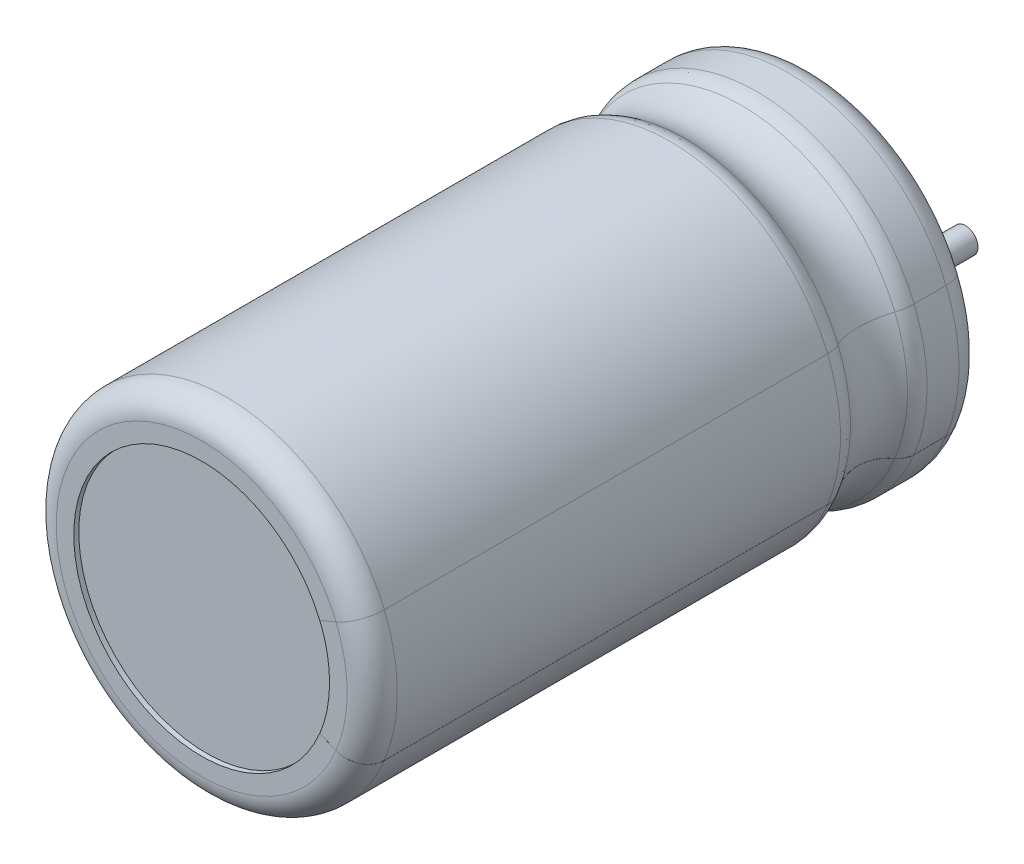
ISO-10303-21;
HEADER;
FILE_DESCRIPTION(('STEP AP214'),'2;1');
FILE_NAME('part.step','',(''),(''),'','','');
FILE_SCHEMA(('AUTOMOTIVE_DESIGN { 1 0 10303 214 1 1 1 1 }'));
ENDSEC;
DATA;
#1=APPLICATION_CONTEXT('core data for automotive mechanical design processes');
#2=APPLICATION_PROTOCOL_DEFINITION('international standard','automotive_design',2000,#1);
#3=PRODUCT_CONTEXT('',#1,'mechanical');
#4=PRODUCT('Part','Part','',(#3));
#5=PRODUCT_RELATED_PRODUCT_CATEGORY('part','',(#4));
#6=PRODUCT_DEFINITION_FORMATION('','',#4);
#7=PRODUCT_DEFINITION_CONTEXT('part definition',#1,'design');
#8=PRODUCT_DEFINITION('design','',#6,#7);
#9=PRODUCT_DEFINITION_SHAPE('','',#8);
#10=(LENGTH_UNIT() NAMED_UNIT(*) SI_UNIT(.MILLI.,.METRE.));
#11=(NAMED_UNIT(*) PLANE_ANGLE_UNIT() SI_UNIT($,.RADIAN.));
#12=(NAMED_UNIT(*) SI_UNIT($,.STERADIAN.) SOLID_ANGLE_UNIT());
#13=UNCERTAINTY_MEASURE_WITH_UNIT(LENGTH_MEASURE(1.E-05),#10,'distance_accuracy_value','');
#14=(GEOMETRIC_REPRESENTATION_CONTEXT(3) GLOBAL_UNCERTAINTY_ASSIGNED_CONTEXT((#13)) GLOBAL_UNIT_ASSIGNED_CONTEXT((#10,
#11,#12)) REPRESENTATION_CONTEXT('',''));
#15=CARTESIAN_POINT('',(0.,0.,0.));
#16=DIRECTION('',(0.,0.,1.));
#17=DIRECTION('',(1.,0.,0.));
#18=AXIS2_PLACEMENT_3D('',#15,#16,#17);
#19=CARTESIAN_POINT('',(0.,0.,-0.000999999999999946));
#20=DIRECTION('',(0.,0.,1.));
#21=DIRECTION('',(1.,0.,0.));
#22=AXIS2_PLACEMENT_3D('',#19,#20,#21);
#23=PLANE('',#22);
#24=CARTESIAN_POINT('',(0.,0.,-0.000999999999999916));
#25=DIRECTION('',(0.,0.,1.));
#26=DIRECTION('',(1.,0.,0.));
#27=AXIS2_PLACEMENT_3D('',#24,#25,#26);
#28=CIRCLE('',#27,2.9);
#29=CARTESIAN_POINT('',(2.67925064428274,1.10978195385874,-0.000999999999999946));
#30=VERTEX_POINT('',#29);
#31=CARTESIAN_POINT('',(2.67925064428274,-1.10978195385875,-0.000999999999999916));
#32=VERTEX_POINT('',#31);
#33=EDGE_CURVE('E293',#30,#32,#28,.T.);
#34=ORIENTED_EDGE('',*,*,#33,.F.);
#35=DIRECTION('',(0.923879532511289,0.382683432365084,0.));
#36=VECTOR('',#35,1.);
#37=CARTESIAN_POINT('',(0.,0.,-0.000999999999999946));
#38=LINE('',#37,#36);
#39=CARTESIAN_POINT('',(2.35589280790379,0.975842752530965,-0.000999999999999265));
#40=VERTEX_POINT('',#39);
#41=EDGE_CURVE('E342',#40,#30,#38,.T.);
#42=ORIENTED_EDGE('',*,*,#41,.F.);
#43=CARTESIAN_POINT('',(0.,0.,-0.000999999999999265));
#44=DIRECTION('',(0.,0.,1.));
#45=DIRECTION('',(1.,0.,0.));
#46=AXIS2_PLACEMENT_3D('',#43,#44,#45);
#47=CIRCLE('',#46,2.55);
#48=CARTESIAN_POINT('',(2.35589280790379,-0.975842752530964,-0.000999999999999946));
#49=VERTEX_POINT('',#48);
#50=EDGE_CURVE('E287',#49,#40,#47,.T.);
#51=ORIENTED_EDGE('',*,*,#50,.F.);
#52=DIRECTION('',(0.923879532511289,-0.382683432365084,0.));
#53=VECTOR('',#52,1.);
#54=CARTESIAN_POINT('',(0.,0.,-0.000999999999999946));
#55=LINE('',#54,#53);
#56=EDGE_CURVE('E314',#49,#32,#55,.T.);
#57=ORIENTED_EDGE('',*,*,#56,.T.);
#58=EDGE_LOOP('',(#34,#42,#51,#57));
#59=FACE_BOUND('',#58,.T.);
#60=CARTESIAN_POINT('',(-1.25,0.,-0.000999999999999916));
#61=DIRECTION('',(0.,0.,1.));
#62=DIRECTION('',(1.,0.,0.));
#63=AXIS2_PLACEMENT_3D('',#60,#61,#62);
#64=CIRCLE('',#63,0.25);
#65=CARTESIAN_POINT('',(-1.,0.,-0.000999999999999916));
#66=VERTEX_POINT('',#65);
#67=EDGE_CURVE('E47',#66,#66,#64,.F.);
#68=ORIENTED_EDGE('',*,*,#67,.F.);
#69=EDGE_LOOP('',(#68));
#70=FACE_BOUND('',#69,.T.);
#71=CARTESIAN_POINT('',(1.25,0.,-0.000999999999999916));
#72=DIRECTION('',(0.,0.,1.));
#73=DIRECTION('',(1.,0.,0.));
#74=AXIS2_PLACEMENT_3D('',#71,#72,#73);
#75=CIRCLE('',#74,0.25);
#76=CARTESIAN_POINT('',(1.5,0.,-0.000999999999999916));
#77=VERTEX_POINT('',#76);
#78=EDGE_CURVE('E12',#77,#77,#75,.F.);
#79=ORIENTED_EDGE('',*,*,#78,.F.);
#80=EDGE_LOOP('',(#79));
#81=FACE_BOUND('',#80,.T.);
#82=ADVANCED_FACE('F38',(#59,#70,#81),#23,.F.);
#83=CARTESIAN_POINT('',(0.,0.,0.));
#84=DIRECTION('',(0.382683432365084,-0.923879532511289,0.));
#85=DIRECTION('',(0.,0.,1.));
#86=AXIS2_PLACEMENT_3D('',#83,#84,#85);
#87=PLANE('',#86);
#88=CARTESIAN_POINT('',(2.67925064428273,1.10978195385876,0.5));
#89=DIRECTION('',(-0.382683432365091,0.923879532511287,0.));
#90=DIRECTION('',(0.,0.,1.));
#91=AXIS2_PLACEMENT_3D('',#88,#89,#90);
#92=CIRCLE('',#91,0.5);
#93=CARTESIAN_POINT('',(3.14119041053837,1.30112367004131,0.5));
#94=VERTEX_POINT('',#93);
#95=CARTESIAN_POINT('',(2.67925064428273,1.10978195385876,0.));
#96=VERTEX_POINT('',#95);
#97=EDGE_CURVE('E221',#94,#96,#92,.T.);
#98=ORIENTED_EDGE('',*,*,#97,.T.);
#99=DIRECTION('',(0.923879532511287,0.382683432365091,0.));
#100=VECTOR('',#99,1.);
#101=CARTESIAN_POINT('',(0.,0.,0.));
#102=LINE('',#101,#100);
#103=CARTESIAN_POINT('',(2.35589280790378,0.975842752530981,0.));
#104=VERTEX_POINT('',#103);
#105=EDGE_CURVE('E223',#104,#96,#102,.T.);
#106=ORIENTED_EDGE('',*,*,#105,.F.);
#107=DIRECTION('',(0.,0.,1.));
#108=VECTOR('',#107,1.);
#109=CARTESIAN_POINT('',(2.35589280790379,0.975842752530965,12.1));
#110=LINE('',#109,#108);
#111=EDGE_CURVE('E284',#104,#40,#110,.F.);
#112=ORIENTED_EDGE('',*,*,#111,.T.);
#113=ORIENTED_EDGE('',*,*,#41,.T.);
#114=CARTESIAN_POINT('',(2.67925064428274,1.10978195385874,0.5));
#115=DIRECTION('',(0.382683432365084,-0.923879532511289,0.));
#116=DIRECTION('',(0.923879532511289,0.382683432365084,0.));
#117=AXIS2_PLACEMENT_3D('',#114,#115,#116);
#118=CIRCLE('',#117,0.501);
#119=CARTESIAN_POINT('',(3.14211429007089,1.30150635347365,0.5));
#120=VERTEX_POINT('',#119);
#121=EDGE_CURVE('E345',#120,#30,#118,.F.);
#122=ORIENTED_EDGE('',*,*,#121,.F.);
#123=DIRECTION('',(0.,0.,1.));
#124=VECTOR('',#123,1.);
#125=CARTESIAN_POINT('',(3.14211429007089,1.30150635347365,0.5));
#126=LINE('',#125,#124);
#127=CARTESIAN_POINT('',(3.14211429007089,1.30150635347365,1.13740784700201));
#128=VERTEX_POINT('',#127);
#129=EDGE_CURVE('E348',#120,#128,#126,.T.);
#130=ORIENTED_EDGE('',*,*,#129,.T.);
#131=CARTESIAN_POINT('',(2.67925064428274,1.10978195385874,1.13740784700201));
#132=DIRECTION('',(0.382683432365084,-0.923879532511289,0.));
#133=DIRECTION('',(0.923879532511289,0.382683432365084,0.));
#134=AXIS2_PLACEMENT_3D('',#131,#132,#133);
#135=CIRCLE('',#134,0.501);
#136=CARTESIAN_POINT('',(3.05291972640545,1.26456075551348,1.43306971404593));
#137=VERTEX_POINT('',#136);
#138=EDGE_CURVE('E351',#128,#137,#135,.T.);
#139=ORIENTED_EDGE('',*,*,#138,.T.);
#140=CARTESIAN_POINT('',(3.76942849264606,1.56134840404954,2.));
#141=DIRECTION('',(0.382683432365084,-0.923879532511289,0.));
#142=DIRECTION('',(0.923879532511289,0.382683432365084,0.));
#143=AXIS2_PLACEMENT_3D('',#140,#141,#142);
#144=CIRCLE('',#143,0.960665222413704);
#145=CARTESIAN_POINT('',(3.05291972640545,1.26456075551348,2.56693028595408));
#146=VERTEX_POINT('',#145);
#147=EDGE_CURVE('E303',#146,#137,#144,.T.);
#148=ORIENTED_EDGE('',*,*,#147,.F.);
#149=CARTESIAN_POINT('',(2.67925064428274,1.10978195385874,2.86259215299799));
#150=DIRECTION('',(0.382683432365084,-0.923879532511289,0.));
#151=DIRECTION('',(0.923879532511289,0.382683432365084,0.));
#152=AXIS2_PLACEMENT_3D('',#149,#150,#151);
#153=CIRCLE('',#152,0.501000000000001);
#154=CARTESIAN_POINT('',(3.14211429007089,1.30150635347365,2.86259215299799));
#155=VERTEX_POINT('',#154);
#156=EDGE_CURVE('E328',#155,#146,#153,.F.);
#157=ORIENTED_EDGE('',*,*,#156,.F.);
#158=DIRECTION('',(0.,0.,1.));
#159=VECTOR('',#158,1.);
#160=CARTESIAN_POINT('',(3.14211429007089,1.30150635347365,2.86259215299799));
#161=LINE('',#160,#159);
#162=CARTESIAN_POINT('',(3.14211429007089,1.30150635347365,11.7));
#163=VERTEX_POINT('',#162);
#164=EDGE_CURVE('E358',#155,#163,#161,.T.);
#165=ORIENTED_EDGE('',*,*,#164,.T.);
#166=CARTESIAN_POINT('',(2.67925064428274,1.10978195385874,11.7));
#167=DIRECTION('',(0.382683432365084,-0.923879532511289,0.));
#168=DIRECTION('',(0.923879532511289,0.382683432365084,0.));
#169=AXIS2_PLACEMENT_3D('',#166,#167,#168);
#170=CIRCLE('',#169,0.501);
#171=CARTESIAN_POINT('',(2.67925064428274,1.10978195385874,12.201));
#172=VERTEX_POINT('',#171);
#173=EDGE_CURVE('E361',#163,#172,#170,.T.);
#174=ORIENTED_EDGE('',*,*,#173,.T.);
#175=DIRECTION('',(-0.923879532511289,-0.382683432365084,0.));
#176=VECTOR('',#175,1.);
#177=CARTESIAN_POINT('',(0.,0.,12.201));
#178=LINE('',#177,#176);
#179=CARTESIAN_POINT('',(2.35496892837128,0.9754600690986,12.201));
#180=VERTEX_POINT('',#179);
#181=EDGE_CURVE('E364',#172,#180,#178,.T.);
#182=ORIENTED_EDGE('',*,*,#181,.T.);
#183=DIRECTION('',(0.,0.,1.));
#184=VECTOR('',#183,1.);
#185=CARTESIAN_POINT('',(2.35496892837127,0.975460069098599,13.5970804277934));
#186=LINE('',#185,#184);
#187=CARTESIAN_POINT('',(2.35496892837127,0.975460069098599,12.101));
#188=VERTEX_POINT('',#187);
#189=EDGE_CURVE('E55',#180,#188,#186,.F.);
#190=ORIENTED_EDGE('',*,*,#189,.T.);
#191=DIRECTION('',(-0.923879532511289,-0.382683432365084,0.));
#192=VECTOR('',#191,1.);
#193=CARTESIAN_POINT('',(-2.17656114601286,-0.901561146012837,12.101));
#194=LINE('',#193,#192);
#195=CARTESIAN_POINT('',(2.35589280790379,0.975842752530965,12.101));
#196=VERTEX_POINT('',#195);
#197=EDGE_CURVE('E369',#196,#188,#194,.T.);
#198=ORIENTED_EDGE('',*,*,#197,.F.);
#199=DIRECTION('',(0.,0.,-1.));
#200=VECTOR('',#199,1.);
#201=CARTESIAN_POINT('',(2.35589280790378,0.975842752530981,0.));
#202=LINE('',#201,#200);
#203=CARTESIAN_POINT('',(2.35589280790378,0.975842752530981,12.2));
#204=VERTEX_POINT('',#203);
#205=EDGE_CURVE('E226',#204,#196,#202,.T.);
#206=ORIENTED_EDGE('',*,*,#205,.F.);
#207=DIRECTION('',(-0.923879532511287,-0.382683432365091,0.));
#208=VECTOR('',#207,1.);
#209=CARTESIAN_POINT('',(0.,0.,12.2));
#210=LINE('',#209,#208);
#211=CARTESIAN_POINT('',(2.67925064428273,1.10978195385876,12.2));
#212=VERTEX_POINT('',#211);
#213=EDGE_CURVE('E229',#212,#204,#210,.T.);
#214=ORIENTED_EDGE('',*,*,#213,.F.);
#215=CARTESIAN_POINT('',(2.67925064428273,1.10978195385876,11.7));
#216=DIRECTION('',(-0.382683432365091,0.923879532511287,0.));
#217=DIRECTION('',(0.,0.,1.));
#218=AXIS2_PLACEMENT_3D('',#215,#216,#217);
#219=CIRCLE('',#218,0.5);
#220=CARTESIAN_POINT('',(3.14119041053837,1.30112367004131,11.7));
#221=VERTEX_POINT('',#220);
#222=EDGE_CURVE('E232',#221,#212,#219,.F.);
#223=ORIENTED_EDGE('',*,*,#222,.F.);
#224=DIRECTION('',(0.,0.,1.));
#225=VECTOR('',#224,1.);
#226=CARTESIAN_POINT('',(3.14119041053838,1.30112367004131,0.));
#227=LINE('',#226,#225);
#228=CARTESIAN_POINT('',(3.14119041053837,1.30112367004131,2.86259215299799));
#229=VERTEX_POINT('',#228);
#230=EDGE_CURVE('E209',#229,#221,#227,.T.);
#231=ORIENTED_EDGE('',*,*,#230,.F.);
#232=CARTESIAN_POINT('',(2.67925064428273,1.10978195385876,2.86259215299799));
#233=DIRECTION('',(-0.382683432365091,0.923879532511287,0.));
#234=DIRECTION('',(0.,0.,1.));
#235=AXIS2_PLACEMENT_3D('',#232,#233,#234);
#236=CIRCLE('',#235,0.500000000000001);
#237=CARTESIAN_POINT('',(3.05217387993414,1.26425181578964,2.56752042940127));
#238=VERTEX_POINT('',#237);
#239=EDGE_CURVE('E188',#238,#229,#236,.F.);
#240=ORIENTED_EDGE('',*,*,#239,.F.);
#241=CARTESIAN_POINT('',(3.76942849264605,1.56134840404957,2.));
#242=DIRECTION('',(-0.382683432365091,0.923879532511287,0.));
#243=DIRECTION('',(0.,0.,1.));
#244=AXIS2_PLACEMENT_3D('',#241,#242,#243);
#245=CIRCLE('',#244,0.961665222413704);
#246=CARTESIAN_POINT('',(3.05217387993414,1.26425181578964,1.43247957059873));
#247=VERTEX_POINT('',#246);
#248=EDGE_CURVE('E199',#238,#247,#245,.F.);
#249=ORIENTED_EDGE('',*,*,#248,.T.);
#250=CARTESIAN_POINT('',(2.67925064428273,1.10978195385876,1.13740784700201));
#251=DIRECTION('',(-0.382683432365091,0.923879532511287,0.));
#252=DIRECTION('',(0.,0.,1.));
#253=AXIS2_PLACEMENT_3D('',#250,#251,#252);
#254=CIRCLE('',#253,0.5);
#255=CARTESIAN_POINT('',(3.14119041053837,1.30112367004131,1.13740784700201));
#256=VERTEX_POINT('',#255);
#257=EDGE_CURVE('E203',#247,#256,#254,.T.);
#258=ORIENTED_EDGE('',*,*,#257,.T.);
#259=DIRECTION('',(0.,0.,1.));
#260=VECTOR('',#259,1.);
#261=CARTESIAN_POINT('',(3.14119041053837,1.30112367004131,0.));
#262=LINE('',#261,#260);
#263=EDGE_CURVE('E218',#94,#256,#262,.T.);
#264=ORIENTED_EDGE('',*,*,#263,.F.);
#265=EDGE_LOOP('',(#98,#106,#112,#113,#122,#130,#139,#148,#157,#165,#174,#182,#190,#198,#206,
#214,#223,#231,#240,#249,#258,#264));
#266=FACE_BOUND('',#265,.T.);
#267=ADVANCED_FACE('F206',(#266),#87,.T.);
#268=CARTESIAN_POINT('',(0.,0.,0.));
#269=DIRECTION('',(-0.382683432365084,-0.923879532511289,0.));
#270=DIRECTION('',(0.,0.,1.));
#271=AXIS2_PLACEMENT_3D('',#268,#269,#270);
#272=PLANE('',#271);
#273=DIRECTION('',(0.923879532511287,-0.382683432365091,0.));
#274=VECTOR('',#273,1.);
#275=CARTESIAN_POINT('',(0.,0.,0.));
#276=LINE('',#275,#274);
#277=CARTESIAN_POINT('',(2.35589280790378,-0.975842752530981,0.));
#278=VERTEX_POINT('',#277);
#279=CARTESIAN_POINT('',(2.67925064428273,-1.10978195385876,0.));
#280=VERTEX_POINT('',#279);
#281=EDGE_CURVE('E248',#278,#280,#276,.T.);
#282=ORIENTED_EDGE('',*,*,#281,.T.);
#283=CARTESIAN_POINT('',(2.67925064428273,-1.10978195385876,0.5));
#284=DIRECTION('',(0.382683432365091,0.923879532511287,0.));
#285=DIRECTION('',(0.,0.,1.));
#286=AXIS2_PLACEMENT_3D('',#283,#284,#285);
#287=CIRCLE('',#286,0.5);
#288=CARTESIAN_POINT('',(3.14119041053837,-1.30112367004131,0.5));
#289=VERTEX_POINT('',#288);
#290=EDGE_CURVE('E245',#289,#280,#287,.T.);
#291=ORIENTED_EDGE('',*,*,#290,.F.);
#292=DIRECTION('',(0.,0.,1.));
#293=VECTOR('',#292,1.);
#294=CARTESIAN_POINT('',(3.14119041053837,-1.30112367004131,0.));
#295=LINE('',#294,#293);
#296=CARTESIAN_POINT('',(3.14119041053837,-1.30112367004131,1.13740784700201));
#297=VERTEX_POINT('',#296);
#298=EDGE_CURVE('E242',#289,#297,#295,.T.);
#299=ORIENTED_EDGE('',*,*,#298,.T.);
#300=CARTESIAN_POINT('',(2.67925064428273,-1.10978195385876,1.13740784700201));
#301=DIRECTION('',(0.382683432365091,0.923879532511287,0.));
#302=DIRECTION('',(0.,0.,1.));
#303=AXIS2_PLACEMENT_3D('',#300,#301,#302);
#304=CIRCLE('',#303,0.5);
#305=CARTESIAN_POINT('',(3.05217387993414,-1.26425181578964,1.43247957059873));
#306=VERTEX_POINT('',#305);
#307=EDGE_CURVE('E239',#306,#297,#304,.T.);
#308=ORIENTED_EDGE('',*,*,#307,.F.);
#309=CARTESIAN_POINT('',(3.76942849264605,-1.56134840404957,2.));
#310=DIRECTION('',(0.382683432365091,0.923879532511287,0.));
#311=DIRECTION('',(0.,0.,1.));
#312=AXIS2_PLACEMENT_3D('',#309,#310,#311);
#313=CIRCLE('',#312,0.961665222413704);
#314=CARTESIAN_POINT('',(3.05217387993414,-1.26425181578964,2.56752042940127));
#315=VERTEX_POINT('',#314);
#316=EDGE_CURVE('E237',#315,#306,#313,.F.);
#317=ORIENTED_EDGE('',*,*,#316,.F.);
#318=CARTESIAN_POINT('',(2.67925064428273,-1.10978195385876,2.86259215299799));
#319=DIRECTION('',(0.382683432365091,0.923879532511287,0.));
#320=DIRECTION('',(0.,0.,1.));
#321=AXIS2_PLACEMENT_3D('',#318,#319,#320);
#322=CIRCLE('',#321,0.500000000000001);
#323=CARTESIAN_POINT('',(3.14119041053837,-1.30112367004131,2.86259215299799));
#324=VERTEX_POINT('',#323);
#325=EDGE_CURVE('E191',#315,#324,#322,.F.);
#326=ORIENTED_EDGE('',*,*,#325,.T.);
#327=DIRECTION('',(0.,0.,1.));
#328=VECTOR('',#327,1.);
#329=CARTESIAN_POINT('',(3.14119041053838,-1.30112367004131,0.));
#330=LINE('',#329,#328);
#331=CARTESIAN_POINT('',(3.14119041053837,-1.30112367004131,11.7));
#332=VERTEX_POINT('',#331);
#333=EDGE_CURVE('E260',#324,#332,#330,.T.);
#334=ORIENTED_EDGE('',*,*,#333,.T.);
#335=CARTESIAN_POINT('',(2.67925064428273,-1.10978195385876,11.7));
#336=DIRECTION('',(0.382683432365091,0.923879532511287,0.));
#337=DIRECTION('',(0.,0.,1.));
#338=AXIS2_PLACEMENT_3D('',#335,#336,#337);
#339=CIRCLE('',#338,0.5);
#340=CARTESIAN_POINT('',(2.67925064428273,-1.10978195385876,12.2));
#341=VERTEX_POINT('',#340);
#342=EDGE_CURVE('E257',#332,#341,#339,.F.);
#343=ORIENTED_EDGE('',*,*,#342,.T.);
#344=DIRECTION('',(-0.923879532511287,0.382683432365091,0.));
#345=VECTOR('',#344,1.);
#346=CARTESIAN_POINT('',(0.,0.,12.2));
#347=LINE('',#346,#345);
#348=CARTESIAN_POINT('',(2.35589280790378,-0.975842752530981,12.2));
#349=VERTEX_POINT('',#348);
#350=EDGE_CURVE('E254',#341,#349,#347,.T.);
#351=ORIENTED_EDGE('',*,*,#350,.T.);
#352=DIRECTION('',(0.,0.,-1.));
#353=VECTOR('',#352,1.);
#354=CARTESIAN_POINT('',(2.35589280790378,-0.975842752530981,0.));
#355=LINE('',#354,#353);
#356=CARTESIAN_POINT('',(2.35589280790378,-0.975842752530981,12.101));
#357=VERTEX_POINT('',#356);
#358=EDGE_CURVE('E251',#349,#357,#355,.T.);
#359=ORIENTED_EDGE('',*,*,#358,.T.);
#360=DIRECTION('',(-0.923879532511289,0.382683432365084,0.));
#361=VECTOR('',#360,1.);
#362=CARTESIAN_POINT('',(-2.17656114601286,0.901561146012837,12.101));
#363=LINE('',#362,#361);
#364=CARTESIAN_POINT('',(2.35496892837128,-0.975460069098599,12.101));
#365=VERTEX_POINT('',#364);
#366=EDGE_CURVE('E299',#357,#365,#363,.T.);
#367=ORIENTED_EDGE('',*,*,#366,.T.);
#368=DIRECTION('',(0.,0.,1.));
#369=VECTOR('',#368,1.);
#370=CARTESIAN_POINT('',(2.35496892837128,-0.975460069098599,13.5970804277934));
#371=LINE('',#370,#369);
#372=CARTESIAN_POINT('',(2.35496892837128,-0.975460069098599,12.201));
#373=VERTEX_POINT('',#372);
#374=EDGE_CURVE('E282',#373,#365,#371,.F.);
#375=ORIENTED_EDGE('',*,*,#374,.F.);
#376=DIRECTION('',(-0.923879532511289,0.382683432365084,0.));
#377=VECTOR('',#376,1.);
#378=CARTESIAN_POINT('',(0.,0.,12.201));
#379=LINE('',#378,#377);
#380=CARTESIAN_POINT('',(2.67925064428274,-1.10978195385874,12.201));
#381=VERTEX_POINT('',#380);
#382=EDGE_CURVE('E283',#381,#373,#379,.T.);
#383=ORIENTED_EDGE('',*,*,#382,.F.);
#384=CARTESIAN_POINT('',(2.67925064428274,-1.10978195385874,11.7));
#385=DIRECTION('',(-0.382683432365084,-0.923879532511289,0.));
#386=DIRECTION('',(0.923879532511289,-0.382683432365084,0.));
#387=AXIS2_PLACEMENT_3D('',#384,#385,#386);
#388=CIRCLE('',#387,0.501);
#389=CARTESIAN_POINT('',(3.14211429007089,-1.30150635347365,11.7));
#390=VERTEX_POINT('',#389);
#391=EDGE_CURVE('E317',#390,#381,#388,.T.);
#392=ORIENTED_EDGE('',*,*,#391,.F.);
#393=DIRECTION('',(0.,0.,1.));
#394=VECTOR('',#393,1.);
#395=CARTESIAN_POINT('',(3.14211429007089,-1.30150635347365,2.86259215299799));
#396=LINE('',#395,#394);
#397=CARTESIAN_POINT('',(3.14211429007089,-1.30150635347365,2.86259215299799));
#398=VERTEX_POINT('',#397);
#399=EDGE_CURVE('E320',#398,#390,#396,.T.);
#400=ORIENTED_EDGE('',*,*,#399,.F.);
#401=CARTESIAN_POINT('',(2.67925064428274,-1.10978195385874,2.86259215299799));
#402=DIRECTION('',(-0.382683432365084,-0.923879532511289,0.));
#403=DIRECTION('',(0.923879532511289,-0.382683432365084,0.));
#404=AXIS2_PLACEMENT_3D('',#401,#402,#403);
#405=CIRCLE('',#404,0.501000000000001);
#406=CARTESIAN_POINT('',(3.05291972640545,-1.26456075551348,2.56693028595408));
#407=VERTEX_POINT('',#406);
#408=EDGE_CURVE('E286',#398,#407,#405,.F.);
#409=ORIENTED_EDGE('',*,*,#408,.T.);
#410=CARTESIAN_POINT('',(3.76942849264606,-1.56134840404954,2.));
#411=DIRECTION('',(-0.382683432365084,-0.923879532511289,0.));
#412=DIRECTION('',(0.923879532511289,-0.382683432365084,0.));
#413=AXIS2_PLACEMENT_3D('',#410,#411,#412);
#414=CIRCLE('',#413,0.960665222413704);
#415=CARTESIAN_POINT('',(3.05291972640545,-1.26456075551348,1.43306971404593));
#416=VERTEX_POINT('',#415);
#417=EDGE_CURVE('E325',#407,#416,#414,.T.);
#418=ORIENTED_EDGE('',*,*,#417,.T.);
#419=CARTESIAN_POINT('',(2.67925064428274,-1.10978195385874,1.13740784700201));
#420=DIRECTION('',(-0.382683432365084,-0.923879532511289,0.));
#421=DIRECTION('',(0.923879532511289,-0.382683432365084,0.));
#422=AXIS2_PLACEMENT_3D('',#419,#420,#421);
#423=CIRCLE('',#422,0.501);
#424=CARTESIAN_POINT('',(3.14211429007089,-1.30150635347365,1.13740784700201));
#425=VERTEX_POINT('',#424);
#426=EDGE_CURVE('E329',#425,#416,#423,.T.);
#427=ORIENTED_EDGE('',*,*,#426,.F.);
#428=DIRECTION('',(0.,0.,1.));
#429=VECTOR('',#428,1.);
#430=CARTESIAN_POINT('',(3.14211429007089,-1.30150635347365,0.5));
#431=LINE('',#430,#429);
#432=CARTESIAN_POINT('',(3.14211429007089,-1.30150635347365,0.5));
#433=VERTEX_POINT('',#432);
#434=EDGE_CURVE('E332',#433,#425,#431,.T.);
#435=ORIENTED_EDGE('',*,*,#434,.F.);
#436=CARTESIAN_POINT('',(2.67925064428274,-1.10978195385874,0.5));
#437=DIRECTION('',(-0.382683432365084,-0.923879532511289,0.));
#438=DIRECTION('',(0.923879532511289,-0.382683432365084,0.));
#439=AXIS2_PLACEMENT_3D('',#436,#437,#438);
#440=CIRCLE('',#439,0.501);
#441=EDGE_CURVE('E335',#433,#32,#440,.F.);
#442=ORIENTED_EDGE('',*,*,#441,.T.);
#443=ORIENTED_EDGE('',*,*,#56,.F.);
#444=DIRECTION('',(0.,0.,-1.));
#445=VECTOR('',#444,1.);
#446=CARTESIAN_POINT('',(2.35589280790379,-0.975842752530964,0.));
#447=LINE('',#446,#445);
#448=EDGE_CURVE('E280',#278,#49,#447,.T.);
#449=ORIENTED_EDGE('',*,*,#448,.F.);
#450=EDGE_LOOP('',(#282,#291,#299,#308,#317,#326,#334,#343,#351,#359,#367,#375,#383,#392,#400,
#409,#418,#427,#435,#442,#443,#449));
#451=FACE_BOUND('',#450,.T.);
#452=ADVANCED_FACE('F442',(#451),#272,.F.);
#453=CARTESIAN_POINT('',(0.,0.,12.1));
#454=DIRECTION('',(0.,0.,1.));
#455=DIRECTION('',(1.,0.,0.));
#456=AXIS2_PLACEMENT_3D('',#453,#454,#455);
#457=CYLINDRICAL_SURFACE('',#456,2.55);
#458=CARTESIAN_POINT('',(0.,0.,0.));
#459=DIRECTION('',(0.,0.,1.));
#460=DIRECTION('',(1.,0.,0.));
#461=AXIS2_PLACEMENT_3D('',#458,#459,#460);
#462=CIRCLE('',#461,2.55);
#463=EDGE_CURVE('E271',#278,#104,#462,.T.);
#464=ORIENTED_EDGE('',*,*,#463,.F.);
#465=ORIENTED_EDGE('',*,*,#448,.T.);
#466=ORIENTED_EDGE('',*,*,#50,.T.);
#467=ORIENTED_EDGE('',*,*,#111,.F.);
#468=EDGE_LOOP('',(#464,#465,#466,#467));
#469=FACE_BOUND('',#468,.T.);
#470=ADVANCED_FACE('F438',(#469),#457,.T.);
#471=CARTESIAN_POINT('',(0.,0.,13.5970804277934));
#472=DIRECTION('',(0.,0.,1.));
#473=DIRECTION('',(1.,0.,0.));
#474=AXIS2_PLACEMENT_3D('',#471,#472,#473);
#475=CYLINDRICAL_SURFACE('',#474,2.549);
#476=CARTESIAN_POINT('',(0.,0.,12.101));
#477=DIRECTION('',(0.,0.,-1.));
#478=DIRECTION('',(-1.,0.,0.));
#479=AXIS2_PLACEMENT_3D('',#476,#477,#478);
#480=CIRCLE('',#479,2.549);
#481=EDGE_CURVE('E288',#188,#365,#480,.F.);
#482=ORIENTED_EDGE('',*,*,#481,.F.);
#483=ORIENTED_EDGE('',*,*,#189,.F.);
#484=CARTESIAN_POINT('',(0.,0.,12.201));
#485=DIRECTION('',(0.,0.,-1.));
#486=DIRECTION('',(-1.,0.,0.));
#487=AXIS2_PLACEMENT_3D('',#484,#485,#486);
#488=CIRCLE('',#487,2.549);
#489=EDGE_CURVE('E290',#180,#373,#488,.F.);
#490=ORIENTED_EDGE('',*,*,#489,.T.);
#491=ORIENTED_EDGE('',*,*,#374,.T.);
#492=EDGE_LOOP('',(#482,#483,#490,#491));
#493=FACE_BOUND('',#492,.T.);
#494=ADVANCED_FACE('F441',(#493),#475,.F.);
#495=CARTESIAN_POINT('',(0.,0.,2.86259215299799));
#496=DIRECTION('',(0.,0.,1.));
#497=DIRECTION('',(1.,0.,0.));
#498=AXIS2_PLACEMENT_3D('',#495,#496,#497);
#499=TOROIDAL_SURFACE('',#498,2.9,0.501000000000001);
#500=CARTESIAN_POINT('',(0.,0.,2.86259215299799));
#501=DIRECTION('',(0.,0.,1.));
#502=DIRECTION('',(1.,0.,0.));
#503=AXIS2_PLACEMENT_3D('',#500,#501,#502);
#504=CIRCLE('',#503,3.401);
#505=EDGE_CURVE('E297',#155,#398,#504,.T.);
#506=ORIENTED_EDGE('',*,*,#505,.F.);
#507=ORIENTED_EDGE('',*,*,#156,.T.);
#508=CARTESIAN_POINT('',(0.,0.,2.56693028595407));
#509=DIRECTION('',(0.,0.,1.));
#510=DIRECTION('',(1.,0.,0.));
#511=AXIS2_PLACEMENT_3D('',#508,#509,#510);
#512=CIRCLE('',#511,3.30445649998004);
#513=EDGE_CURVE('E300',#146,#407,#512,.T.);
#514=ORIENTED_EDGE('',*,*,#513,.T.);
#515=ORIENTED_EDGE('',*,*,#408,.F.);
#516=EDGE_LOOP('',(#506,#507,#514,#515));
#517=FACE_BOUND('',#516,.T.);
#518=ADVANCED_FACE('F40',(#517),#499,.T.);
#519=CARTESIAN_POINT('',(0.,0.,13.5970804277934));
#520=DIRECTION('',(0.,0.,1.));
#521=DIRECTION('',(1.,0.,0.));
#522=AXIS2_PLACEMENT_3D('',#519,#520,#521);
#523=CYLINDRICAL_SURFACE('',#522,3.401);
#524=CARTESIAN_POINT('',(0.,0.,11.7));
#525=DIRECTION('',(0.,0.,1.));
#526=DIRECTION('',(1.,0.,0.));
#527=AXIS2_PLACEMENT_3D('',#524,#525,#526);
#528=CIRCLE('',#527,3.401);
#529=EDGE_CURVE('E295',#163,#390,#528,.T.);
#530=ORIENTED_EDGE('',*,*,#529,.F.);
#531=ORIENTED_EDGE('',*,*,#164,.F.);
#532=ORIENTED_EDGE('',*,*,#505,.T.);
#533=ORIENTED_EDGE('',*,*,#399,.T.);
#534=EDGE_LOOP('',(#530,#531,#532,#533));
#535=FACE_BOUND('',#534,.T.);
#536=ADVANCED_FACE('F477',(#535),#523,.T.);
#537=CARTESIAN_POINT('',(0.,0.,11.7));
#538=DIRECTION('',(0.,0.,1.));
#539=DIRECTION('',(1.,0.,0.));
#540=AXIS2_PLACEMENT_3D('',#537,#538,#539);
#541=TOROIDAL_SURFACE('',#540,2.9,0.501);
#542=CARTESIAN_POINT('',(0.,0.,12.201));
#543=DIRECTION('',(0.,0.,1.));
#544=DIRECTION('',(1.,0.,0.));
#545=AXIS2_PLACEMENT_3D('',#542,#543,#544);
#546=CIRCLE('',#545,2.9);
#547=EDGE_CURVE('E292',#172,#381,#546,.T.);
#548=ORIENTED_EDGE('',*,*,#547,.F.);
#549=ORIENTED_EDGE('',*,*,#173,.F.);
#550=ORIENTED_EDGE('',*,*,#529,.T.);
#551=ORIENTED_EDGE('',*,*,#391,.T.);
#552=EDGE_LOOP('',(#548,#549,#550,#551));
#553=FACE_BOUND('',#552,.T.);
#554=ADVANCED_FACE('F474',(#553),#541,.T.);
#555=CARTESIAN_POINT('',(0.,0.,12.201));
#556=DIRECTION('',(0.,0.,-1.));
#557=DIRECTION('',(-1.,0.,0.));
#558=AXIS2_PLACEMENT_3D('',#555,#556,#557);
#559=PLANE('',#558);
#560=ORIENTED_EDGE('',*,*,#489,.F.);
#561=ORIENTED_EDGE('',*,*,#181,.F.);
#562=ORIENTED_EDGE('',*,*,#547,.T.);
#563=ORIENTED_EDGE('',*,*,#382,.T.);
#564=EDGE_LOOP('',(#560,#561,#562,#563));
#565=FACE_BOUND('',#564,.T.);
#566=ADVANCED_FACE('F457',(#565),#559,.F.);
#567=CARTESIAN_POINT('',(0.,0.,0.5));
#568=DIRECTION('',(0.,0.,1.));
#569=DIRECTION('',(1.,0.,0.));
#570=AXIS2_PLACEMENT_3D('',#567,#568,#569);
#571=TOROIDAL_SURFACE('',#570,2.9,0.501);
#572=CARTESIAN_POINT('',(0.,0.,0.5));
#573=DIRECTION('',(0.,0.,1.));
#574=DIRECTION('',(1.,0.,0.));
#575=AXIS2_PLACEMENT_3D('',#572,#573,#574);
#576=CIRCLE('',#575,3.401);
#577=EDGE_CURVE('E307',#120,#433,#576,.T.);
#578=ORIENTED_EDGE('',*,*,#577,.F.);
#579=ORIENTED_EDGE('',*,*,#121,.T.);
#580=ORIENTED_EDGE('',*,*,#33,.T.);
#581=ORIENTED_EDGE('',*,*,#441,.F.);
#582=EDGE_LOOP('',(#578,#579,#580,#581));
#583=FACE_BOUND('',#582,.T.);
#584=ADVANCED_FACE('F453',(#583),#571,.T.);
#585=CARTESIAN_POINT('',(0.,0.,13.5970804277934));
#586=DIRECTION('',(0.,0.,1.));
#587=DIRECTION('',(1.,0.,0.));
#588=AXIS2_PLACEMENT_3D('',#585,#586,#587);
#589=CYLINDRICAL_SURFACE('',#588,3.401);
#590=CARTESIAN_POINT('',(0.,0.,1.13740784700201));
#591=DIRECTION('',(0.,0.,1.));
#592=DIRECTION('',(1.,0.,0.));
#593=AXIS2_PLACEMENT_3D('',#590,#591,#592);
#594=CIRCLE('',#593,3.401);
#595=EDGE_CURVE('E305',#128,#425,#594,.T.);
#596=ORIENTED_EDGE('',*,*,#595,.F.);
#597=ORIENTED_EDGE('',*,*,#129,.F.);
#598=ORIENTED_EDGE('',*,*,#577,.T.);
#599=ORIENTED_EDGE('',*,*,#434,.T.);
#600=EDGE_LOOP('',(#596,#597,#598,#599));
#601=FACE_BOUND('',#600,.T.);
#602=ADVANCED_FACE('F456',(#601),#589,.T.);
#603=CARTESIAN_POINT('',(0.,0.,1.13740784700201));
#604=DIRECTION('',(0.,0.,1.));
#605=DIRECTION('',(1.,0.,0.));
#606=AXIS2_PLACEMENT_3D('',#603,#604,#605);
#607=TOROIDAL_SURFACE('',#606,2.9,0.501);
#608=CARTESIAN_POINT('',(0.,0.,1.43306971404593));
#609=DIRECTION('',(0.,0.,1.));
#610=DIRECTION('',(1.,0.,0.));
#611=AXIS2_PLACEMENT_3D('',#608,#609,#610);
#612=CIRCLE('',#611,3.30445649998004);
#613=EDGE_CURVE('E302',#137,#416,#612,.T.);
#614=ORIENTED_EDGE('',*,*,#613,.F.);
#615=ORIENTED_EDGE('',*,*,#138,.F.);
#616=ORIENTED_EDGE('',*,*,#595,.T.);
#617=ORIENTED_EDGE('',*,*,#426,.T.);
#618=EDGE_LOOP('',(#614,#615,#616,#617));
#619=FACE_BOUND('',#618,.T.);
#620=ADVANCED_FACE('F464',(#619),#607,.T.);
#621=CARTESIAN_POINT('',(0.,0.,2.));
#622=DIRECTION('',(0.,0.,1.));
#623=DIRECTION('',(1.,0.,0.));
#624=AXIS2_PLACEMENT_3D('',#621,#622,#623);
#625=TOROIDAL_SURFACE('',#624,4.08,0.960665222413704);
#626=ORIENTED_EDGE('',*,*,#147,.T.);
#627=ORIENTED_EDGE('',*,*,#613,.T.);
#628=ORIENTED_EDGE('',*,*,#417,.F.);
#629=ORIENTED_EDGE('',*,*,#513,.F.);
#630=EDGE_LOOP('',(#626,#627,#628,#629));
#631=FACE_BOUND('',#630,.T.);
#632=ADVANCED_FACE('F450',(#631),#625,.F.);
#633=CARTESIAN_POINT('',(-2.55,0.,12.101));
#634=DIRECTION('',(0.,0.,-1.));
#635=DIRECTION('',(-1.,0.,0.));
#636=AXIS2_PLACEMENT_3D('',#633,#634,#635);
#637=PLANE('',#636);
#638=ORIENTED_EDGE('',*,*,#481,.T.);
#639=ORIENTED_EDGE('',*,*,#366,.F.);
#640=CARTESIAN_POINT('',(0.,0.,12.101));
#641=DIRECTION('',(0.,0.,-1.));
#642=DIRECTION('',(-1.,0.,0.));
#643=AXIS2_PLACEMENT_3D('',#640,#641,#642);
#644=CIRCLE('',#643,2.55);
#645=EDGE_CURVE('E195',#357,#196,#644,.F.);
#646=ORIENTED_EDGE('',*,*,#645,.T.);
#647=ORIENTED_EDGE('',*,*,#197,.T.);
#648=EDGE_LOOP('',(#638,#639,#646,#647));
#649=FACE_BOUND('',#648,.T.);
#650=ADVANCED_FACE('F419',(#649),#637,.F.);
#651=CARTESIAN_POINT('',(0.,0.,13.5970804277934));
#652=DIRECTION('',(0.,0.,1.));
#653=DIRECTION('',(1.,0.,0.));
#654=AXIS2_PLACEMENT_3D('',#651,#652,#653);
#655=CYLINDRICAL_SURFACE('',#654,2.55);
#656=ORIENTED_EDGE('',*,*,#205,.T.);
#657=ORIENTED_EDGE('',*,*,#645,.F.);
#658=ORIENTED_EDGE('',*,*,#358,.F.);
#659=CARTESIAN_POINT('',(0.,0.,12.2));
#660=DIRECTION('',(0.,0.,1.));
#661=DIRECTION('',(1.,0.,0.));
#662=AXIS2_PLACEMENT_3D('',#659,#660,#661);
#663=CIRCLE('',#662,2.55);
#664=EDGE_CURVE('E269',#349,#204,#663,.T.);
#665=ORIENTED_EDGE('',*,*,#664,.T.);
#666=EDGE_LOOP('',(#656,#657,#658,#665));
#667=FACE_BOUND('',#666,.T.);
#668=ADVANCED_FACE('F404',(#667),#655,.F.);
#669=CARTESIAN_POINT('',(0.,0.,2.86259215299799));
#670=DIRECTION('',(0.,0.,1.));
#671=DIRECTION('',(1.,0.,0.));
#672=AXIS2_PLACEMENT_3D('',#669,#670,#671);
#673=TOROIDAL_SURFACE('',#672,2.9,0.500000000000001);
#674=CARTESIAN_POINT('',(0.,0.,2.56752042940127));
#675=DIRECTION('',(0.,0.,1.));
#676=DIRECTION('',(1.,0.,0.));
#677=AXIS2_PLACEMENT_3D('',#674,#675,#676);
#678=CIRCLE('',#677,3.30364920157689);
#679=EDGE_CURVE('E184',#315,#238,#678,.T.);
#680=ORIENTED_EDGE('',*,*,#679,.T.);
#681=ORIENTED_EDGE('',*,*,#239,.T.);
#682=CARTESIAN_POINT('',(0.,0.,2.86259215299799));
#683=DIRECTION('',(0.,0.,1.));
#684=DIRECTION('',(1.,0.,0.));
#685=AXIS2_PLACEMENT_3D('',#682,#683,#684);
#686=CIRCLE('',#685,3.4);
#687=EDGE_CURVE('E263',#324,#229,#686,.T.);
#688=ORIENTED_EDGE('',*,*,#687,.F.);
#689=ORIENTED_EDGE('',*,*,#325,.F.);
#690=EDGE_LOOP('',(#680,#681,#688,#689));
#691=FACE_BOUND('',#690,.T.);
#692=ADVANCED_FACE('F186',(#691),#673,.T.);
#693=CARTESIAN_POINT('',(0.,0.,2.));
#694=DIRECTION('',(0.,0.,1.));
#695=DIRECTION('',(1.,0.,0.));
#696=AXIS2_PLACEMENT_3D('',#693,#694,#695);
#697=TOROIDAL_SURFACE('',#696,4.08,0.961665222413704);
#698=CARTESIAN_POINT('',(0.,0.,1.43247957059873));
#699=DIRECTION('',(0.,0.,1.));
#700=DIRECTION('',(1.,0.,0.));
#701=AXIS2_PLACEMENT_3D('',#698,#699,#700);
#702=CIRCLE('',#701,3.30364920157689);
#703=EDGE_CURVE('E196',#306,#247,#702,.T.);
#704=ORIENTED_EDGE('',*,*,#703,.T.);
#705=ORIENTED_EDGE('',*,*,#248,.F.);
#706=ORIENTED_EDGE('',*,*,#679,.F.);
#707=ORIENTED_EDGE('',*,*,#316,.T.);
#708=EDGE_LOOP('',(#704,#705,#706,#707));
#709=FACE_BOUND('',#708,.T.);
#710=ADVANCED_FACE('F200',(#709),#697,.F.);
#711=CARTESIAN_POINT('',(0.,0.,1.13740784700201));
#712=DIRECTION('',(0.,0.,1.));
#713=DIRECTION('',(1.,0.,0.));
#714=AXIS2_PLACEMENT_3D('',#711,#712,#713);
#715=TOROIDAL_SURFACE('',#714,2.9,0.5);
#716=CARTESIAN_POINT('',(0.,0.,1.13740784700201));
#717=DIRECTION('',(0.,0.,1.));
#718=DIRECTION('',(1.,0.,0.));
#719=AXIS2_PLACEMENT_3D('',#716,#717,#718);
#720=CIRCLE('',#719,3.4);
#721=EDGE_CURVE('E277',#297,#256,#720,.T.);
#722=ORIENTED_EDGE('',*,*,#721,.T.);
#723=ORIENTED_EDGE('',*,*,#257,.F.);
#724=ORIENTED_EDGE('',*,*,#703,.F.);
#725=ORIENTED_EDGE('',*,*,#307,.T.);
#726=EDGE_LOOP('',(#722,#723,#724,#725));
#727=FACE_BOUND('',#726,.T.);
#728=ADVANCED_FACE('F431',(#727),#715,.T.);
#729=CARTESIAN_POINT('',(0.,0.,13.5970804277934));
#730=DIRECTION('',(0.,0.,1.));
#731=DIRECTION('',(1.,0.,0.));
#732=AXIS2_PLACEMENT_3D('',#729,#730,#731);
#733=CYLINDRICAL_SURFACE('',#732,3.4);
#734=CARTESIAN_POINT('',(0.,0.,0.5));
#735=DIRECTION('',(0.,0.,1.));
#736=DIRECTION('',(1.,0.,0.));
#737=AXIS2_PLACEMENT_3D('',#734,#735,#736);
#738=CIRCLE('',#737,3.4);
#739=EDGE_CURVE('E275',#289,#94,#738,.T.);
#740=ORIENTED_EDGE('',*,*,#739,.T.);
#741=ORIENTED_EDGE('',*,*,#263,.T.);
#742=ORIENTED_EDGE('',*,*,#721,.F.);
#743=ORIENTED_EDGE('',*,*,#298,.F.);
#744=EDGE_LOOP('',(#740,#741,#742,#743));
#745=FACE_BOUND('',#744,.T.);
#746=ADVANCED_FACE('F427',(#745),#733,.T.);
#747=CARTESIAN_POINT('',(0.,0.,0.5));
#748=DIRECTION('',(0.,0.,1.));
#749=DIRECTION('',(1.,0.,0.));
#750=AXIS2_PLACEMENT_3D('',#747,#748,#749);
#751=TOROIDAL_SURFACE('',#750,2.9,0.5);
#752=CARTESIAN_POINT('',(0.,0.,0.));
#753=DIRECTION('',(0.,0.,1.));
#754=DIRECTION('',(1.,0.,0.));
#755=AXIS2_PLACEMENT_3D('',#752,#753,#754);
#756=CIRCLE('',#755,2.9);
#757=EDGE_CURVE('E273',#280,#96,#756,.T.);
#758=ORIENTED_EDGE('',*,*,#757,.T.);
#759=ORIENTED_EDGE('',*,*,#97,.F.);
#760=ORIENTED_EDGE('',*,*,#739,.F.);
#761=ORIENTED_EDGE('',*,*,#290,.T.);
#762=EDGE_LOOP('',(#758,#759,#760,#761));
#763=FACE_BOUND('',#762,.T.);
#764=ADVANCED_FACE('F423',(#763),#751,.T.);
#765=CARTESIAN_POINT('',(0.,0.,0.));
#766=DIRECTION('',(0.,0.,1.));
#767=DIRECTION('',(1.,0.,0.));
#768=AXIS2_PLACEMENT_3D('',#765,#766,#767);
#769=PLANE('',#768);
#770=ORIENTED_EDGE('',*,*,#463,.T.);
#771=ORIENTED_EDGE('',*,*,#105,.T.);
#772=ORIENTED_EDGE('',*,*,#757,.F.);
#773=ORIENTED_EDGE('',*,*,#281,.F.);
#774=EDGE_LOOP('',(#770,#771,#772,#773));
#775=FACE_BOUND('',#774,.T.);
#776=ADVANCED_FACE('F415',(#775),#769,.F.);
#777=CARTESIAN_POINT('',(0.,0.,12.2));
#778=DIRECTION('',(0.,0.,-1.));
#779=DIRECTION('',(-1.,0.,0.));
#780=AXIS2_PLACEMENT_3D('',#777,#778,#779);
#781=PLANE('',#780);
#782=CARTESIAN_POINT('',(0.,0.,12.2));
#783=DIRECTION('',(0.,0.,1.));
#784=DIRECTION('',(1.,0.,0.));
#785=AXIS2_PLACEMENT_3D('',#782,#783,#784);
#786=CIRCLE('',#785,2.9);
#787=EDGE_CURVE('E267',#341,#212,#786,.T.);
#788=ORIENTED_EDGE('',*,*,#787,.T.);
#789=ORIENTED_EDGE('',*,*,#213,.T.);
#790=ORIENTED_EDGE('',*,*,#664,.F.);
#791=ORIENTED_EDGE('',*,*,#350,.F.);
#792=EDGE_LOOP('',(#788,#789,#790,#791));
#793=FACE_BOUND('',#792,.T.);
#794=ADVANCED_FACE('F411',(#793),#781,.F.);
#795=CARTESIAN_POINT('',(0.,0.,11.7));
#796=DIRECTION('',(0.,0.,1.));
#797=DIRECTION('',(1.,0.,0.));
#798=AXIS2_PLACEMENT_3D('',#795,#796,#797);
#799=TOROIDAL_SURFACE('',#798,2.9,0.5);
#800=CARTESIAN_POINT('',(0.,0.,11.7));
#801=DIRECTION('',(0.,0.,1.));
#802=DIRECTION('',(1.,0.,0.));
#803=AXIS2_PLACEMENT_3D('',#800,#801,#802);
#804=CIRCLE('',#803,3.4);
#805=EDGE_CURVE('E265',#332,#221,#804,.T.);
#806=ORIENTED_EDGE('',*,*,#805,.T.);
#807=ORIENTED_EDGE('',*,*,#222,.T.);
#808=ORIENTED_EDGE('',*,*,#787,.F.);
#809=ORIENTED_EDGE('',*,*,#342,.F.);
#810=EDGE_LOOP('',(#806,#807,#808,#809));
#811=FACE_BOUND('',#810,.T.);
#812=ADVANCED_FACE('F407',(#811),#799,.T.);
#813=CARTESIAN_POINT('',(0.,0.,13.5970804277934));
#814=DIRECTION('',(0.,0.,1.));
#815=DIRECTION('',(1.,0.,0.));
#816=AXIS2_PLACEMENT_3D('',#813,#814,#815);
#817=CYLINDRICAL_SURFACE('',#816,3.4);
#818=ORIENTED_EDGE('',*,*,#333,.F.);
#819=ORIENTED_EDGE('',*,*,#687,.T.);
#820=ORIENTED_EDGE('',*,*,#230,.T.);
#821=ORIENTED_EDGE('',*,*,#805,.F.);
#822=EDGE_LOOP('',(#818,#819,#820,#821));
#823=FACE_BOUND('',#822,.T.);
#824=ADVANCED_FACE('F400',(#823),#817,.T.);
#825=CARTESIAN_POINT('',(-1.25,0.,-1.778));
#826=DIRECTION('',(0.,0.,1.));
#827=DIRECTION('',(1.,0.,0.));
#828=AXIS2_PLACEMENT_3D('',#825,#826,#827);
#829=CYLINDRICAL_SURFACE('',#828,0.25);
#830=CARTESIAN_POINT('',(-1.25,0.,-1.778));
#831=DIRECTION('',(0.,0.,-1.));
#832=DIRECTION('',(-1.,0.,0.));
#833=AXIS2_PLACEMENT_3D('',#830,#831,#832);
#834=CIRCLE('',#833,0.25);
#835=CARTESIAN_POINT('',(-1.5,0.,-1.778));
#836=VERTEX_POINT('',#835);
#837=EDGE_CURVE('E210',#836,#836,#834,.T.);
#838=ORIENTED_EDGE('',*,*,#837,.F.);
#839=EDGE_LOOP('',(#838));
#840=FACE_BOUND('',#839,.T.);
#841=ORIENTED_EDGE('',*,*,#67,.T.);
#842=EDGE_LOOP('',(#841));
#843=FACE_BOUND('',#842,.T.);
#844=ADVANCED_FACE('F374',(#840,#843),#829,.T.);
#845=CARTESIAN_POINT('',(-1.25,0.,-1.778));
#846=DIRECTION('',(0.,0.,-1.));
#847=DIRECTION('',(-1.,0.,0.));
#848=AXIS2_PLACEMENT_3D('',#845,#846,#847);
#849=PLANE('',#848);
#850=ORIENTED_EDGE('',*,*,#837,.T.);
#851=EDGE_LOOP('',(#850));
#852=FACE_BOUND('',#851,.T.);
#853=ADVANCED_FACE('F385',(#852),#849,.T.);
#854=CARTESIAN_POINT('',(1.25,0.,-1.778));
#855=DIRECTION('',(0.,0.,1.));
#856=DIRECTION('',(1.,0.,0.));
#857=AXIS2_PLACEMENT_3D('',#854,#855,#856);
#858=CYLINDRICAL_SURFACE('',#857,0.25);
#859=CARTESIAN_POINT('',(1.25,0.,-1.778));
#860=DIRECTION('',(0.,0.,-1.));
#861=DIRECTION('',(1.,0.,0.));
#862=AXIS2_PLACEMENT_3D('',#859,#860,#861);
#863=CIRCLE('',#862,0.25);
#864=CARTESIAN_POINT('',(1.5,0.,-1.778));
#865=VERTEX_POINT('',#864);
#866=EDGE_CURVE('E213',#865,#865,#863,.T.);
#867=ORIENTED_EDGE('',*,*,#866,.F.);
#868=EDGE_LOOP('',(#867));
#869=FACE_BOUND('',#868,.T.);
#870=ORIENTED_EDGE('',*,*,#78,.T.);
#871=EDGE_LOOP('',(#870));
#872=FACE_BOUND('',#871,.T.);
#873=ADVANCED_FACE('F382',(#869,#872),#858,.T.);
#874=CARTESIAN_POINT('',(1.25,0.,-1.778));
#875=DIRECTION('',(0.,0.,1.));
#876=DIRECTION('',(1.,0.,0.));
#877=AXIS2_PLACEMENT_3D('',#874,#875,#876);
#878=PLANE('',#877);
#879=ORIENTED_EDGE('',*,*,#866,.T.);
#880=EDGE_LOOP('',(#879));
#881=FACE_BOUND('',#880,.T.);
#882=ADVANCED_FACE('F384',(#881),#878,.F.);
#883=CLOSED_SHELL('',(#82,#267,#452,#470,#494,#518,#536,#554,#566,#584,#602,#620,#632,#650,#668,
#692,#710,#728,#746,#764,#776,#794,#812,#824,#844,#853,#873,#882));
#884=MANIFOLD_SOLID_BREP('B2',#883);
#885=ADVANCED_BREP_SHAPE_REPRESENTATION('',(#18,#884),#14);
#886=SHAPE_DEFINITION_REPRESENTATION(#9,#885);
ENDSEC;
END-ISO-10303-21;
